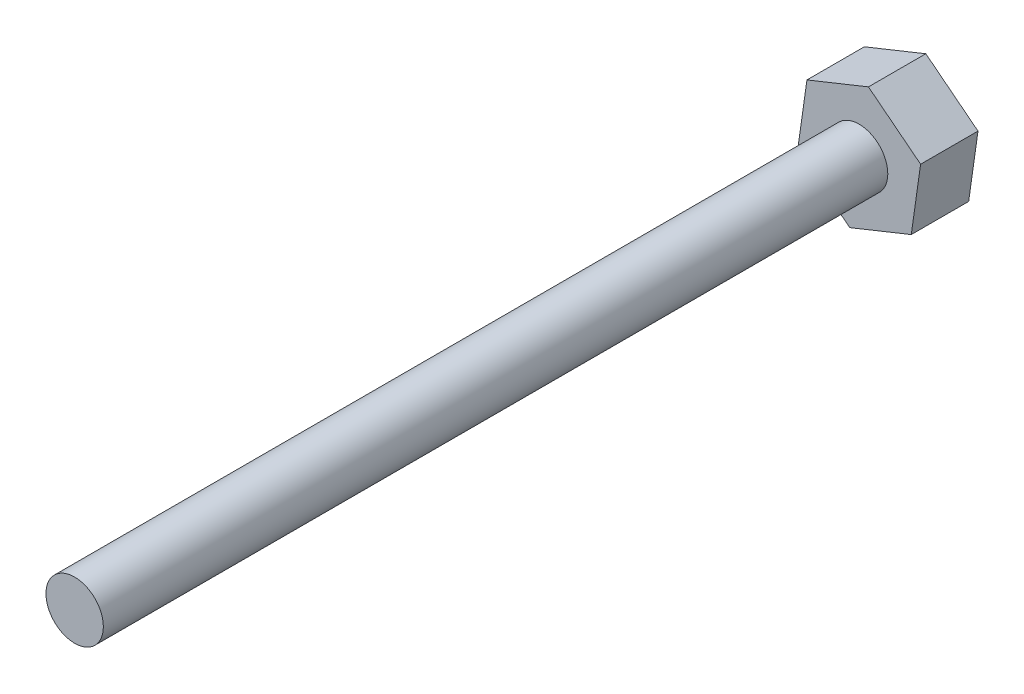
ISO-10303-21;
HEADER;
FILE_DESCRIPTION(('STEP AP214'),'2;1');
FILE_NAME('part.step','',(''),(''),'','','');
FILE_SCHEMA(('AUTOMOTIVE_DESIGN { 1 0 10303 214 1 1 1 1 }'));
ENDSEC;
DATA;
#1=APPLICATION_CONTEXT('core data for automotive mechanical design processes');
#2=APPLICATION_PROTOCOL_DEFINITION('international standard','automotive_design',2000,#1);
#3=PRODUCT_CONTEXT('',#1,'mechanical');
#4=PRODUCT('Part','Part','',(#3));
#5=PRODUCT_RELATED_PRODUCT_CATEGORY('part','',(#4));
#6=PRODUCT_DEFINITION_FORMATION('','',#4);
#7=PRODUCT_DEFINITION_CONTEXT('part definition',#1,'design');
#8=PRODUCT_DEFINITION('design','',#6,#7);
#9=PRODUCT_DEFINITION_SHAPE('','',#8);
#10=(LENGTH_UNIT() NAMED_UNIT(*) SI_UNIT(.MILLI.,.METRE.));
#11=(NAMED_UNIT(*) PLANE_ANGLE_UNIT() SI_UNIT($,.RADIAN.));
#12=(NAMED_UNIT(*) SI_UNIT($,.STERADIAN.) SOLID_ANGLE_UNIT());
#13=UNCERTAINTY_MEASURE_WITH_UNIT(LENGTH_MEASURE(1.E-05),#10,'distance_accuracy_value','');
#14=(GEOMETRIC_REPRESENTATION_CONTEXT(3) GLOBAL_UNCERTAINTY_ASSIGNED_CONTEXT((#13)) GLOBAL_UNIT_ASSIGNED_CONTEXT((#10,
#11,#12)) REPRESENTATION_CONTEXT('',''));
#15=CARTESIAN_POINT('',(0.,0.,0.));
#16=DIRECTION('',(0.,0.,1.));
#17=DIRECTION('',(1.,0.,0.));
#18=AXIS2_PLACEMENT_3D('',#15,#16,#17);
#19=CARTESIAN_POINT('',(0.,0.,3.));
#20=DIRECTION('',(0.,0.,1.));
#21=DIRECTION('',(1.,0.,0.));
#22=AXIS2_PLACEMENT_3D('',#19,#20,#21);
#23=PLANE('',#22);
#24=DIRECTION('',(-0.927834117546046,-0.372993096876536,0.));
#25=VECTOR('',#24,1.);
#26=CARTESIAN_POINT('',(0.488076541955978,3.42954534730076,3.));
#27=LINE('',#26,#25);
#28=CARTESIAN_POINT('',(0.488076541955978,3.42954534730076,3.));
#29=VERTEX_POINT('',#28);
#30=CARTESIAN_POINT('',(-2.72603512321519,2.13745935797552,3.));
#31=VERTEX_POINT('',#30);
#32=EDGE_CURVE('E128',#29,#31,#27,.T.);
#33=ORIENTED_EDGE('',*,*,#32,.T.);
#34=DIRECTION('',(-0.140895561441713,-0.990024464731061,0.));
#35=VECTOR('',#34,1.);
#36=CARTESIAN_POINT('',(-2.72603512321519,2.13745935797552,3.));
#37=LINE('',#36,#35);
#38=CARTESIAN_POINT('',(-3.21411166517117,-1.29208598932524,3.));
#39=VERTEX_POINT('',#38);
#40=EDGE_CURVE('E86',#31,#39,#37,.T.);
#41=ORIENTED_EDGE('',*,*,#40,.T.);
#42=DIRECTION('',(0.786938556104334,-0.617031367854525,0.));
#43=VECTOR('',#42,1.);
#44=CARTESIAN_POINT('',(-3.21411166517117,-1.29208598932524,3.));
#45=LINE('',#44,#43);
#46=CARTESIAN_POINT('',(-0.488076541955976,-3.42954534730076,3.));
#47=VERTEX_POINT('',#46);
#48=EDGE_CURVE('E99',#39,#47,#45,.T.);
#49=ORIENTED_EDGE('',*,*,#48,.T.);
#50=DIRECTION('',(0.927834117546047,0.372993096876536,0.));
#51=VECTOR('',#50,1.);
#52=CARTESIAN_POINT('',(-0.488076541955976,-3.42954534730076,3.));
#53=LINE('',#52,#51);
#54=CARTESIAN_POINT('',(2.72603512321519,-2.13745935797552,3.));
#55=VERTEX_POINT('',#54);
#56=EDGE_CURVE('E93',#47,#55,#53,.T.);
#57=ORIENTED_EDGE('',*,*,#56,.T.);
#58=DIRECTION('',(0.140895561441713,0.990024464731061,0.));
#59=VECTOR('',#58,1.);
#60=CARTESIAN_POINT('',(2.72603512321519,-2.13745935797552,3.));
#61=LINE('',#60,#59);
#62=CARTESIAN_POINT('',(3.21411166517117,1.29208598932524,3.));
#63=VERTEX_POINT('',#62);
#64=EDGE_CURVE('E97',#55,#63,#61,.T.);
#65=ORIENTED_EDGE('',*,*,#64,.T.);
#66=DIRECTION('',(-0.786938556104334,0.617031367854525,0.));
#67=VECTOR('',#66,1.);
#68=CARTESIAN_POINT('',(3.21411166517117,1.29208598932524,3.));
#69=LINE('',#68,#67);
#70=EDGE_CURVE('E49',#63,#29,#69,.T.);
#71=ORIENTED_EDGE('',*,*,#70,.T.);
#72=EDGE_LOOP('',(#33,#41,#49,#57,#65,#71));
#73=FACE_BOUND('',#72,.T.);
#74=CARTESIAN_POINT('',(0.,0.,3.));
#75=DIRECTION('',(0.,0.,1.));
#76=DIRECTION('',(1.,0.,0.));
#77=AXIS2_PLACEMENT_3D('',#74,#75,#76);
#78=CIRCLE('',#77,1.5);
#79=CARTESIAN_POINT('',(1.5,0.,3.));
#80=VERTEX_POINT('',#79);
#81=EDGE_CURVE('E168',#80,#80,#78,.T.);
#82=ORIENTED_EDGE('',*,*,#81,.F.);
#83=EDGE_LOOP('',(#82));
#84=FACE_BOUND('',#83,.T.);
#85=ADVANCED_FACE('F32',(#73,#84),#23,.T.);
#86=CARTESIAN_POINT('',(0.488076541955978,3.42954534730076,3.));
#87=DIRECTION('',(0.372993096876536,-0.927834117546047,0.));
#88=DIRECTION('',(0.927834117546047,0.372993096876536,0.));
#89=AXIS2_PLACEMENT_3D('',#86,#87,#88);
#90=PLANE('',#89);
#91=DIRECTION('',(-0.927834117546046,-0.372993096876536,0.));
#92=VECTOR('',#91,1.);
#93=CARTESIAN_POINT('',(0.488076541955978,3.42954534730076,0.));
#94=LINE('',#93,#92);
#95=CARTESIAN_POINT('',(0.488076541955978,3.42954534730076,0.));
#96=VERTEX_POINT('',#95);
#97=CARTESIAN_POINT('',(-2.72603512321519,2.13745935797552,0.));
#98=VERTEX_POINT('',#97);
#99=EDGE_CURVE('E117',#96,#98,#94,.T.);
#100=ORIENTED_EDGE('',*,*,#99,.T.);
#101=DIRECTION('',(0.,0.,-1.));
#102=VECTOR('',#101,1.);
#103=CARTESIAN_POINT('',(-2.72603512321519,2.13745935797552,3.));
#104=LINE('',#103,#102);
#105=EDGE_CURVE('E11',#31,#98,#104,.T.);
#106=ORIENTED_EDGE('',*,*,#105,.F.);
#107=ORIENTED_EDGE('',*,*,#32,.F.);
#108=DIRECTION('',(0.,0.,-1.));
#109=VECTOR('',#108,1.);
#110=CARTESIAN_POINT('',(0.488076541955978,3.42954534730076,3.));
#111=LINE('',#110,#109);
#112=EDGE_CURVE('E113',#29,#96,#111,.T.);
#113=ORIENTED_EDGE('',*,*,#112,.T.);
#114=EDGE_LOOP('',(#100,#106,#107,#113));
#115=FACE_BOUND('',#114,.T.);
#116=ADVANCED_FACE('F34',(#115),#90,.F.);
#117=CARTESIAN_POINT('',(-2.72603512321519,2.13745935797552,3.));
#118=DIRECTION('',(0.990024464731061,-0.140895561441713,0.));
#119=DIRECTION('',(0.140895561441713,0.990024464731061,0.));
#120=AXIS2_PLACEMENT_3D('',#117,#118,#119);
#121=PLANE('',#120);
#122=DIRECTION('',(-0.140895561441713,-0.990024464731061,0.));
#123=VECTOR('',#122,1.);
#124=CARTESIAN_POINT('',(-2.72603512321519,2.13745935797552,0.));
#125=LINE('',#124,#123);
#126=CARTESIAN_POINT('',(-3.21411166517117,-1.29208598932524,0.));
#127=VERTEX_POINT('',#126);
#128=EDGE_CURVE('E120',#98,#127,#125,.T.);
#129=ORIENTED_EDGE('',*,*,#128,.T.);
#130=DIRECTION('',(0.,0.,-1.));
#131=VECTOR('',#130,1.);
#132=CARTESIAN_POINT('',(-3.21411166517117,-1.29208598932524,3.));
#133=LINE('',#132,#131);
#134=EDGE_CURVE('E41',#39,#127,#133,.T.);
#135=ORIENTED_EDGE('',*,*,#134,.F.);
#136=ORIENTED_EDGE('',*,*,#40,.F.);
#137=ORIENTED_EDGE('',*,*,#105,.T.);
#138=EDGE_LOOP('',(#129,#135,#136,#137));
#139=FACE_BOUND('',#138,.T.);
#140=ADVANCED_FACE('F156',(#139),#121,.F.);
#141=CARTESIAN_POINT('',(-3.21411166517117,-1.29208598932524,3.));
#142=DIRECTION('',(0.617031367854525,0.786938556104334,0.));
#143=DIRECTION('',(-0.786938556104334,0.617031367854525,0.));
#144=AXIS2_PLACEMENT_3D('',#141,#142,#143);
#145=PLANE('',#144);
#146=DIRECTION('',(0.786938556104334,-0.617031367854525,0.));
#147=VECTOR('',#146,1.);
#148=CARTESIAN_POINT('',(-3.21411166517117,-1.29208598932524,0.));
#149=LINE('',#148,#147);
#150=CARTESIAN_POINT('',(-0.488076541955976,-3.42954534730076,0.));
#151=VERTEX_POINT('',#150);
#152=EDGE_CURVE('E123',#127,#151,#149,.T.);
#153=ORIENTED_EDGE('',*,*,#152,.T.);
#154=DIRECTION('',(0.,0.,-1.));
#155=VECTOR('',#154,1.);
#156=CARTESIAN_POINT('',(-0.488076541955976,-3.42954534730076,3.));
#157=LINE('',#156,#155);
#158=EDGE_CURVE('E108',#47,#151,#157,.T.);
#159=ORIENTED_EDGE('',*,*,#158,.F.);
#160=ORIENTED_EDGE('',*,*,#48,.F.);
#161=ORIENTED_EDGE('',*,*,#134,.T.);
#162=EDGE_LOOP('',(#153,#159,#160,#161));
#163=FACE_BOUND('',#162,.T.);
#164=ADVANCED_FACE('F134',(#163),#145,.F.);
#165=CARTESIAN_POINT('',(-0.488076541955976,-3.42954534730076,3.));
#166=DIRECTION('',(-0.372993096876536,0.927834117546047,0.));
#167=DIRECTION('',(-0.927834117546047,-0.372993096876536,0.));
#168=AXIS2_PLACEMENT_3D('',#165,#166,#167);
#169=PLANE('',#168);
#170=DIRECTION('',(0.927834117546047,0.372993096876536,0.));
#171=VECTOR('',#170,1.);
#172=CARTESIAN_POINT('',(-0.488076541955976,-3.42954534730076,0.));
#173=LINE('',#172,#171);
#174=CARTESIAN_POINT('',(2.72603512321519,-2.13745935797552,0.));
#175=VERTEX_POINT('',#174);
#176=EDGE_CURVE('E107',#151,#175,#173,.T.);
#177=ORIENTED_EDGE('',*,*,#176,.T.);
#178=DIRECTION('',(0.,0.,-1.));
#179=VECTOR('',#178,1.);
#180=CARTESIAN_POINT('',(2.72603512321519,-2.13745935797552,3.));
#181=LINE('',#180,#179);
#182=EDGE_CURVE('E104',#55,#175,#181,.T.);
#183=ORIENTED_EDGE('',*,*,#182,.F.);
#184=ORIENTED_EDGE('',*,*,#56,.F.);
#185=ORIENTED_EDGE('',*,*,#158,.T.);
#186=EDGE_LOOP('',(#177,#183,#184,#185));
#187=FACE_BOUND('',#186,.T.);
#188=ADVANCED_FACE('F105',(#187),#169,.F.);
#189=CARTESIAN_POINT('',(2.72603512321519,-2.13745935797552,3.));
#190=DIRECTION('',(-0.990024464731061,0.140895561441713,0.));
#191=DIRECTION('',(-0.140895561441713,-0.990024464731061,0.));
#192=AXIS2_PLACEMENT_3D('',#189,#190,#191);
#193=PLANE('',#192);
#194=DIRECTION('',(0.140895561441713,0.990024464731061,0.));
#195=VECTOR('',#194,1.);
#196=CARTESIAN_POINT('',(2.72603512321519,-2.13745935797552,0.));
#197=LINE('',#196,#195);
#198=CARTESIAN_POINT('',(3.21411166517117,1.29208598932524,0.));
#199=VERTEX_POINT('',#198);
#200=EDGE_CURVE('E72',#175,#199,#197,.T.);
#201=ORIENTED_EDGE('',*,*,#200,.T.);
#202=DIRECTION('',(0.,0.,-1.));
#203=VECTOR('',#202,1.);
#204=CARTESIAN_POINT('',(3.21411166517117,1.29208598932524,3.));
#205=LINE('',#204,#203);
#206=EDGE_CURVE('E109',#63,#199,#205,.T.);
#207=ORIENTED_EDGE('',*,*,#206,.F.);
#208=ORIENTED_EDGE('',*,*,#64,.F.);
#209=ORIENTED_EDGE('',*,*,#182,.T.);
#210=EDGE_LOOP('',(#201,#207,#208,#209));
#211=FACE_BOUND('',#210,.T.);
#212=ADVANCED_FACE('F111',(#211),#193,.F.);
#213=CARTESIAN_POINT('',(3.21411166517117,1.29208598932524,3.));
#214=DIRECTION('',(-0.617031367854525,-0.786938556104334,0.));
#215=DIRECTION('',(0.786938556104334,-0.617031367854525,0.));
#216=AXIS2_PLACEMENT_3D('',#213,#214,#215);
#217=PLANE('',#216);
#218=DIRECTION('',(-0.786938556104334,0.617031367854525,0.));
#219=VECTOR('',#218,1.);
#220=CARTESIAN_POINT('',(3.21411166517117,1.29208598932524,0.));
#221=LINE('',#220,#219);
#222=EDGE_CURVE('E78',#199,#96,#221,.T.);
#223=ORIENTED_EDGE('',*,*,#222,.T.);
#224=ORIENTED_EDGE('',*,*,#112,.F.);
#225=ORIENTED_EDGE('',*,*,#70,.F.);
#226=ORIENTED_EDGE('',*,*,#206,.T.);
#227=EDGE_LOOP('',(#223,#224,#225,#226));
#228=FACE_BOUND('',#227,.T.);
#229=ADVANCED_FACE('F141',(#228),#217,.F.);
#230=CARTESIAN_POINT('',(0.,0.,0.));
#231=DIRECTION('',(0.,0.,1.));
#232=DIRECTION('',(1.,0.,0.));
#233=AXIS2_PLACEMENT_3D('',#230,#231,#232);
#234=PLANE('',#233);
#235=ORIENTED_EDGE('',*,*,#99,.F.);
#236=ORIENTED_EDGE('',*,*,#222,.F.);
#237=ORIENTED_EDGE('',*,*,#200,.F.);
#238=ORIENTED_EDGE('',*,*,#176,.F.);
#239=ORIENTED_EDGE('',*,*,#152,.F.);
#240=ORIENTED_EDGE('',*,*,#128,.F.);
#241=EDGE_LOOP('',(#235,#236,#237,#238,#239,#240));
#242=FACE_BOUND('',#241,.T.);
#243=ADVANCED_FACE('F137',(#242),#234,.F.);
#244=CARTESIAN_POINT('',(0.,0.,44.));
#245=DIRECTION('',(0.,0.,-1.));
#246=DIRECTION('',(-1.,0.,0.));
#247=AXIS2_PLACEMENT_3D('',#244,#245,#246);
#248=CYLINDRICAL_SURFACE('',#247,1.5);
#249=CARTESIAN_POINT('',(0.,0.,44.));
#250=DIRECTION('',(0.,0.,1.));
#251=DIRECTION('',(1.,0.,0.));
#252=AXIS2_PLACEMENT_3D('',#249,#250,#251);
#253=CIRCLE('',#252,1.5);
#254=CARTESIAN_POINT('',(1.5,0.,44.));
#255=VERTEX_POINT('',#254);
#256=EDGE_CURVE('E121',#255,#255,#253,.T.);
#257=ORIENTED_EDGE('',*,*,#256,.F.);
#258=EDGE_LOOP('',(#257));
#259=FACE_BOUND('',#258,.T.);
#260=ORIENTED_EDGE('',*,*,#81,.T.);
#261=EDGE_LOOP('',(#260));
#262=FACE_BOUND('',#261,.T.);
#263=ADVANCED_FACE('F148',(#259,#262),#248,.T.);
#264=CARTESIAN_POINT('',(0.,0.,44.));
#265=DIRECTION('',(0.,0.,1.));
#266=DIRECTION('',(1.,0.,0.));
#267=AXIS2_PLACEMENT_3D('',#264,#265,#266);
#268=PLANE('',#267);
#269=ORIENTED_EDGE('',*,*,#256,.T.);
#270=EDGE_LOOP('',(#269));
#271=FACE_BOUND('',#270,.T.);
#272=ADVANCED_FACE('F160',(#271),#268,.T.);
#273=CLOSED_SHELL('',(#85,#116,#140,#164,#188,#212,#229,#243,#263,#272));
#274=MANIFOLD_SOLID_BREP('B2',#273);
#275=ADVANCED_BREP_SHAPE_REPRESENTATION('',(#18,#274),#14);
#276=SHAPE_DEFINITION_REPRESENTATION(#9,#275);
ENDSEC;
END-ISO-10303-21;
